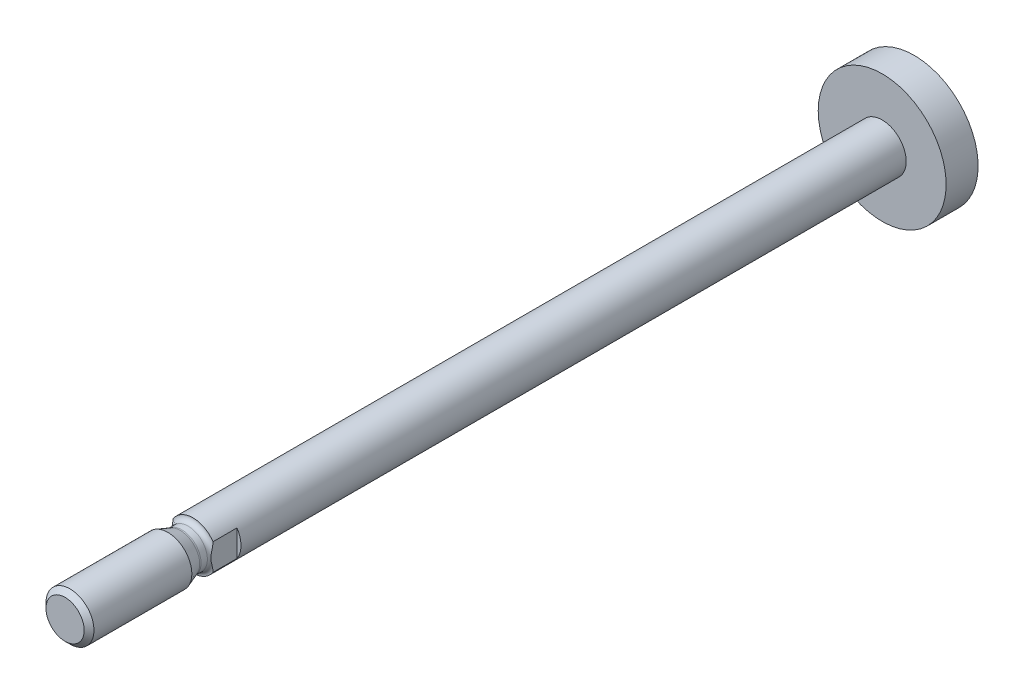
ISO-10303-21;
HEADER;
FILE_DESCRIPTION(('STEP AP214'),'2;1');
FILE_NAME('part.step','',(''),(''),'','','');
FILE_SCHEMA(('AUTOMOTIVE_DESIGN { 1 0 10303 214 1 1 1 1 }'));
ENDSEC;
DATA;
#1=APPLICATION_CONTEXT('core data for automotive mechanical design processes');
#2=APPLICATION_PROTOCOL_DEFINITION('international standard','automotive_design',2000,#1);
#3=PRODUCT_CONTEXT('',#1,'mechanical');
#4=PRODUCT('Part','Part','',(#3));
#5=PRODUCT_RELATED_PRODUCT_CATEGORY('part','',(#4));
#6=PRODUCT_DEFINITION_FORMATION('','',#4);
#7=PRODUCT_DEFINITION_CONTEXT('part definition',#1,'design');
#8=PRODUCT_DEFINITION('design','',#6,#7);
#9=PRODUCT_DEFINITION_SHAPE('','',#8);
#10=(LENGTH_UNIT() NAMED_UNIT(*) SI_UNIT(.MILLI.,.METRE.));
#11=(NAMED_UNIT(*) PLANE_ANGLE_UNIT() SI_UNIT($,.RADIAN.));
#12=(NAMED_UNIT(*) SI_UNIT($,.STERADIAN.) SOLID_ANGLE_UNIT());
#13=UNCERTAINTY_MEASURE_WITH_UNIT(LENGTH_MEASURE(1.E-05),#10,'distance_accuracy_value','');
#14=(GEOMETRIC_REPRESENTATION_CONTEXT(3) GLOBAL_UNCERTAINTY_ASSIGNED_CONTEXT((#13)) GLOBAL_UNIT_ASSIGNED_CONTEXT((#10,
#11,#12)) REPRESENTATION_CONTEXT('',''));
#15=CARTESIAN_POINT('',(0.,0.,0.));
#16=DIRECTION('',(0.,0.,1.));
#17=DIRECTION('',(1.,0.,0.));
#18=AXIS2_PLACEMENT_3D('',#15,#16,#17);
#19=CARTESIAN_POINT('',(0.,0.,-85.2));
#20=DIRECTION('',(0.,0.,-1.));
#21=DIRECTION('',(-1.,0.,0.));
#22=AXIS2_PLACEMENT_3D('',#19,#20,#21);
#23=CYLINDRICAL_SURFACE('',#22,3.);
#24=CARTESIAN_POINT('',(0.,0.,-81.2));
#25=DIRECTION('',(0.,0.,-1.));
#26=DIRECTION('',(-1.,0.,0.));
#27=AXIS2_PLACEMENT_3D('',#24,#25,#26);
#28=CIRCLE('',#27,3.);
#29=CARTESIAN_POINT('',(-3.,0.,-81.2));
#30=VERTEX_POINT('',#29);
#31=EDGE_CURVE('E80',#30,#30,#28,.T.);
#32=ORIENTED_EDGE('',*,*,#31,.F.);
#33=EDGE_LOOP('',(#32));
#34=FACE_BOUND('',#33,.T.);
#35=DIRECTION('',(0.,0.,-1.));
#36=VECTOR('',#35,1.);
#37=CARTESIAN_POINT('',(-2.5,1.6583123951777,4.99999999999909));
#38=LINE('',#37,#36);
#39=CARTESIAN_POINT('',(-2.5,1.65831239517778,4.99999999999909));
#40=VERTEX_POINT('',#39);
#41=CARTESIAN_POINT('',(-2.5,1.6583123951777,2.));
#42=VERTEX_POINT('',#41);
#43=EDGE_CURVE('E69',#40,#42,#38,.T.);
#44=ORIENTED_EDGE('',*,*,#43,.F.);
#45=CARTESIAN_POINT('',(0.,0.,5.));
#46=DIRECTION('',(0.,0.,-1.));
#47=DIRECTION('',(-0.833333333333321,0.552770798392585,0.));
#48=AXIS2_PLACEMENT_3D('',#45,#46,#47);
#49=CIRCLE('',#48,3.);
#50=CARTESIAN_POINT('',(2.5,1.6583123951777,5.));
#51=VERTEX_POINT('',#50);
#52=EDGE_CURVE('E55',#40,#51,#49,.T.);
#53=ORIENTED_EDGE('',*,*,#52,.T.);
#54=DIRECTION('',(0.,0.,1.));
#55=VECTOR('',#54,1.);
#56=CARTESIAN_POINT('',(2.5,1.6583123951777,2.));
#57=LINE('',#56,#55);
#58=CARTESIAN_POINT('',(2.5,1.6583123951777,2.));
#59=VERTEX_POINT('',#58);
#60=EDGE_CURVE('E68',#59,#51,#57,.T.);
#61=ORIENTED_EDGE('',*,*,#60,.F.);
#62=CARTESIAN_POINT('',(0.,0.,2.));
#63=DIRECTION('',(0.,0.,1.));
#64=DIRECTION('',(0.833333333333333,-0.552770798392567,0.));
#65=AXIS2_PLACEMENT_3D('',#62,#63,#64);
#66=CIRCLE('',#65,3.);
#67=CARTESIAN_POINT('',(2.5,-1.6583123951777,2.));
#68=VERTEX_POINT('',#67);
#69=EDGE_CURVE('E90',#68,#59,#66,.T.);
#70=ORIENTED_EDGE('',*,*,#69,.F.);
#71=DIRECTION('',(0.,0.,-1.));
#72=VECTOR('',#71,1.);
#73=CARTESIAN_POINT('',(2.5,-1.6583123951777,4.99999999999909));
#74=LINE('',#73,#72);
#75=CARTESIAN_POINT('',(2.5,-1.65831239517778,4.99999999999909));
#76=VERTEX_POINT('',#75);
#77=EDGE_CURVE('E94',#76,#68,#74,.T.);
#78=ORIENTED_EDGE('',*,*,#77,.F.);
#79=CARTESIAN_POINT('',(0.,0.,5.));
#80=DIRECTION('',(0.,0.,-1.));
#81=DIRECTION('',(0.833333333333321,-0.552770798392585,0.));
#82=AXIS2_PLACEMENT_3D('',#79,#80,#81);
#83=CIRCLE('',#82,3.);
#84=CARTESIAN_POINT('',(-2.5,-1.6583123951777,5.));
#85=VERTEX_POINT('',#84);
#86=EDGE_CURVE('E99',#76,#85,#83,.T.);
#87=ORIENTED_EDGE('',*,*,#86,.T.);
#88=DIRECTION('',(0.,0.,1.));
#89=VECTOR('',#88,1.);
#90=CARTESIAN_POINT('',(-2.5,-1.6583123951777,2.));
#91=LINE('',#90,#89);
#92=CARTESIAN_POINT('',(-2.5,-1.6583123951777,2.));
#93=VERTEX_POINT('',#92);
#94=EDGE_CURVE('E77',#93,#85,#91,.T.);
#95=ORIENTED_EDGE('',*,*,#94,.F.);
#96=CARTESIAN_POINT('',(0.,0.,2.));
#97=DIRECTION('',(0.,0.,1.));
#98=DIRECTION('',(-0.833333333333333,0.552770798392567,0.));
#99=AXIS2_PLACEMENT_3D('',#96,#97,#98);
#100=CIRCLE('',#99,3.);
#101=EDGE_CURVE('E34',#42,#93,#100,.T.);
#102=ORIENTED_EDGE('',*,*,#101,.F.);
#103=EDGE_LOOP('',(#44,#53,#61,#70,#78,#87,#95,#102));
#104=FACE_BOUND('',#103,.T.);
#105=ADVANCED_FACE('F17',(#34,#104),#23,.T.);
#106=CARTESIAN_POINT('',(0.,3.,-81.2));
#107=DIRECTION('',(0.,0.,-1.));
#108=DIRECTION('',(-1.,0.,0.));
#109=AXIS2_PLACEMENT_3D('',#106,#107,#108);
#110=PLANE('',#109);
#111=CARTESIAN_POINT('',(0.,0.,-81.2));
#112=DIRECTION('',(0.,0.,-1.));
#113=DIRECTION('',(-1.,0.,0.));
#114=AXIS2_PLACEMENT_3D('',#111,#112,#113);
#115=CIRCLE('',#114,8.);
#116=CARTESIAN_POINT('',(-8.,0.,-81.2));
#117=VERTEX_POINT('',#116);
#118=EDGE_CURVE('E109',#117,#117,#115,.T.);
#119=ORIENTED_EDGE('',*,*,#118,.F.);
#120=EDGE_LOOP('',(#119));
#121=FACE_BOUND('',#120,.T.);
#122=ORIENTED_EDGE('',*,*,#31,.T.);
#123=EDGE_LOOP('',(#122));
#124=FACE_BOUND('',#123,.T.);
#125=ADVANCED_FACE('F119',(#121,#124),#110,.F.);
#126=CARTESIAN_POINT('',(-2.5,-5.,6.));
#127=DIRECTION('',(-1.,0.,0.));
#128=DIRECTION('',(0.,0.,1.));
#129=AXIS2_PLACEMENT_3D('',#126,#127,#128);
#130=PLANE('',#129);
#131=ORIENTED_EDGE('',*,*,#43,.T.);
#132=DIRECTION('',(0.,1.,0.));
#133=VECTOR('',#132,1.);
#134=CARTESIAN_POINT('',(-2.5,-1.6583123951777,2.));
#135=LINE('',#134,#133);
#136=EDGE_CURVE('E31',#93,#42,#135,.T.);
#137=ORIENTED_EDGE('',*,*,#136,.F.);
#138=ORIENTED_EDGE('',*,*,#94,.T.);
#139=CARTESIAN_POINT('',(-2.5,-1.65831829169541,5.00000000000885));
#140=CARTESIAN_POINT('',(-2.5,-1.63491532877898,4.99999992973286));
#141=CARTESIAN_POINT('',(-2.5,-1.61149482046343,5.00041875125078));
#142=CARTESIAN_POINT('',(-2.5,-1.45329985222676,5.00583269208804));
#143=CARTESIAN_POINT('',(-2.5,-1.32008048780736,5.02291400118435));
#144=CARTESIAN_POINT('',(-2.5,-1.05526955750932,5.07061231229032));
#145=CARTESIAN_POINT('',(-2.5,-0.924587612317244,5.10126759833291));
#146=CARTESIAN_POINT('',(-2.5,-0.663403044787274,5.16510709196525));
#147=CARTESIAN_POINT('',(-2.5,-0.532955207719693,5.19852985989759));
#148=CARTESIAN_POINT('',(-2.5,-0.3351050647231,5.2375995275498));
#149=CARTESIAN_POINT('',(-2.5,-0.269167347488754,5.24862076501824));
#150=CARTESIAN_POINT('',(-2.5,-0.135243346078244,5.26407313721784));
#151=CARTESIAN_POINT('',(-2.5,-0.0659370163481887,5.26833752096453));
#152=CARTESIAN_POINT('',(-2.5,0.105328995263471,5.26833752096453));
#153=CARTESIAN_POINT('',(-2.5,0.204452731333742,5.25835623262265));
#154=CARTESIAN_POINT('',(-2.5,0.406625741882635,5.22538789194667));
#155=CARTESIAN_POINT('',(-2.5,0.506215999796735,5.20297777521126));
#156=CARTESIAN_POINT('',(-2.5,0.779290928519066,5.1376308856199));
#157=CARTESIAN_POINT('',(-2.5,0.952215632476059,5.09230978675975));
#158=CARTESIAN_POINT('',(-2.5,1.30286487229559,5.02381276997557));
#159=CARTESIAN_POINT('',(-2.5,1.47927159521248,4.9999999503834));
#160=CARTESIAN_POINT('',(-2.5,1.65831293934871,5.00000000000008));
#161=B_SPLINE_CURVE_WITH_KNOTS('',3,(#139,#140,#141,#142,#143,#144,#145,#146,#147,#148,#149,
#150,#151,#152,#153,#154,#155,#156,#157,#158,#159,#160),.UNSPECIFIED.,.F.,.F.,(4,2,2,2,2,2,2,2,
2,2,4),(9.64041016296276,9.70681215541733,10.0900053470554,10.4731985386934,10.8564820300666,
11.0481237757532,11.2397655214398,11.5458975492694,11.852029577099,12.3859060442365,
12.919782511374),.UNSPECIFIED.);
#162=EDGE_CURVE('E60',#85,#40,#161,.T.);
#163=ORIENTED_EDGE('',*,*,#162,.T.);
#164=EDGE_LOOP('',(#131,#137,#138,#163));
#165=FACE_BOUND('',#164,.T.);
#166=ADVANCED_FACE('F75',(#165),#130,.T.);
#167=CARTESIAN_POINT('',(0.,0.,5.6000000000001));
#168=DIRECTION('',(0.,0.,-1.));
#169=DIRECTION('',(-1.,0.,0.));
#170=AXIS2_PLACEMENT_3D('',#167,#168,#169);
#171=TOROIDAL_SURFACE('',#170,3.0000000000001,0.600000000000099);
#172=ORIENTED_EDGE('',*,*,#52,.F.);
#173=ORIENTED_EDGE('',*,*,#162,.F.);
#174=ORIENTED_EDGE('',*,*,#86,.F.);
#175=CARTESIAN_POINT('',(2.5,1.65831829169541,5.00000000000885));
#176=CARTESIAN_POINT('',(2.5,1.63491532877898,4.99999992973286));
#177=CARTESIAN_POINT('',(2.5,1.61149482046343,5.00041875125078));
#178=CARTESIAN_POINT('',(2.5,1.45329985222676,5.00583269208804));
#179=CARTESIAN_POINT('',(2.5,1.32008048780736,5.02291400118435));
#180=CARTESIAN_POINT('',(2.5,1.05526955750931,5.07061231229032));
#181=CARTESIAN_POINT('',(2.5,0.924587612317241,5.10126759833291));
#182=CARTESIAN_POINT('',(2.5,0.663403044787271,5.16510709196525));
#183=CARTESIAN_POINT('',(2.5,0.532955207719693,5.19852985989759));
#184=CARTESIAN_POINT('',(2.5,0.335105064723101,5.2375995275498));
#185=CARTESIAN_POINT('',(2.5,0.269167347488754,5.24862076501824));
#186=CARTESIAN_POINT('',(2.5,0.135243346078244,5.26407313721784));
#187=CARTESIAN_POINT('',(2.5,0.065937016348187,5.26833752096453));
#188=CARTESIAN_POINT('',(2.5,-0.105328995263471,5.26833752096453));
#189=CARTESIAN_POINT('',(2.5,-0.204452731333741,5.25835623262266));
#190=CARTESIAN_POINT('',(2.5,-0.406625741882635,5.22538789194667));
#191=CARTESIAN_POINT('',(2.5,-0.506215999796737,5.20297777521126));
#192=CARTESIAN_POINT('',(2.5,-0.779290928519067,5.1376308856199));
#193=CARTESIAN_POINT('',(2.5,-0.95221563247606,5.09230978675975));
#194=CARTESIAN_POINT('',(2.5,-1.30286487229559,5.02381276997557));
#195=CARTESIAN_POINT('',(2.5,-1.47927159521248,4.9999999503834));
#196=CARTESIAN_POINT('',(2.5,-1.65831293934871,5.00000000000008));
#197=B_SPLINE_CURVE_WITH_KNOTS('',3,(#175,#176,#177,#178,#179,#180,#181,#182,#183,#184,#185,
#186,#187,#188,#189,#190,#191,#192,#193,#194,#195,#196),.UNSPECIFIED.,.F.,.F.,(4,2,2,2,2,2,2,2,
2,2,4),(9.64041016296277,9.70681215541734,10.0900053470554,10.4731985386934,10.8564820300666,
11.0481237757532,11.2397655214398,11.5458975492694,11.852029577099,12.3859060442365,
12.9197825113741),.UNSPECIFIED.);
#198=EDGE_CURVE('E63',#51,#76,#197,.T.);
#199=ORIENTED_EDGE('',*,*,#198,.F.);
#200=EDGE_LOOP('',(#172,#173,#174,#199));
#201=FACE_BOUND('',#200,.T.);
#202=CARTESIAN_POINT('',(0.,0.,5.6));
#203=DIRECTION('',(0.,0.,-1.));
#204=DIRECTION('',(-1.,0.,0.));
#205=AXIS2_PLACEMENT_3D('',#202,#203,#204);
#206=CIRCLE('',#205,2.4);
#207=CARTESIAN_POINT('',(-2.4,0.,5.6));
#208=VERTEX_POINT('',#207);
#209=EDGE_CURVE('E155',#208,#208,#206,.T.);
#210=ORIENTED_EDGE('',*,*,#209,.T.);
#211=EDGE_LOOP('',(#210));
#212=FACE_BOUND('',#211,.T.);
#213=ADVANCED_FACE('F57',(#201,#212),#171,.F.);
#214=CARTESIAN_POINT('',(2.5,5.,6.));
#215=DIRECTION('',(1.,0.,0.));
#216=DIRECTION('',(0.,0.,-1.));
#217=AXIS2_PLACEMENT_3D('',#214,#215,#216);
#218=PLANE('',#217);
#219=ORIENTED_EDGE('',*,*,#77,.T.);
#220=DIRECTION('',(0.,-1.,0.));
#221=VECTOR('',#220,1.);
#222=CARTESIAN_POINT('',(2.5,1.6583123951777,2.));
#223=LINE('',#222,#221);
#224=EDGE_CURVE('E163',#59,#68,#223,.T.);
#225=ORIENTED_EDGE('',*,*,#224,.F.);
#226=ORIENTED_EDGE('',*,*,#60,.T.);
#227=ORIENTED_EDGE('',*,*,#198,.T.);
#228=EDGE_LOOP('',(#219,#225,#226,#227));
#229=FACE_BOUND('',#228,.T.);
#230=ADVANCED_FACE('F175',(#229),#218,.T.);
#231=CARTESIAN_POINT('',(0.,0.,2.));
#232=DIRECTION('',(0.,0.,1.));
#233=DIRECTION('',(1.,0.,0.));
#234=AXIS2_PLACEMENT_3D('',#231,#232,#233);
#235=PLANE('',#234);
#236=ORIENTED_EDGE('',*,*,#69,.T.);
#237=ORIENTED_EDGE('',*,*,#224,.T.);
#238=EDGE_LOOP('',(#236,#237));
#239=FACE_BOUND('',#238,.T.);
#240=ADVANCED_FACE('F184',(#239),#235,.T.);
#241=ORIENTED_EDGE('',*,*,#101,.T.);
#242=ORIENTED_EDGE('',*,*,#136,.T.);
#243=EDGE_LOOP('',(#241,#242));
#244=FACE_BOUND('',#243,.T.);
#245=ADVANCED_FACE('F187',(#244),#235,.T.);
#246=CARTESIAN_POINT('',(0.,0.,-85.2));
#247=DIRECTION('',(0.,0.,-1.));
#248=DIRECTION('',(-1.,0.,0.));
#249=AXIS2_PLACEMENT_3D('',#246,#247,#248);
#250=CYLINDRICAL_SURFACE('',#249,8.);
#251=CARTESIAN_POINT('',(0.,0.,-85.2));
#252=DIRECTION('',(0.,0.,-1.));
#253=DIRECTION('',(-1.,0.,0.));
#254=AXIS2_PLACEMENT_3D('',#251,#252,#253);
#255=CIRCLE('',#254,8.);
#256=CARTESIAN_POINT('',(-8.,0.,-85.2));
#257=VERTEX_POINT('',#256);
#258=EDGE_CURVE('E165',#257,#257,#255,.T.);
#259=ORIENTED_EDGE('',*,*,#258,.F.);
#260=EDGE_LOOP('',(#259));
#261=FACE_BOUND('',#260,.T.);
#262=ORIENTED_EDGE('',*,*,#118,.T.);
#263=EDGE_LOOP('',(#262));
#264=FACE_BOUND('',#263,.T.);
#265=ADVANCED_FACE('F117',(#261,#264),#250,.T.);
#266=CARTESIAN_POINT('',(0.,0.,4.));
#267=DIRECTION('',(0.,0.,-1.));
#268=DIRECTION('',(-1.,0.,0.));
#269=AXIS2_PLACEMENT_3D('',#266,#267,#268);
#270=CYLINDRICAL_SURFACE('',#269,2.4);
#271=ORIENTED_EDGE('',*,*,#209,.F.);
#272=EDGE_LOOP('',(#271));
#273=FACE_BOUND('',#272,.T.);
#274=CARTESIAN_POINT('',(0.,0.,6.3942038115749));
#275=DIRECTION('',(0.,0.,-1.));
#276=DIRECTION('',(-1.,0.,0.));
#277=AXIS2_PLACEMENT_3D('',#274,#275,#276);
#278=CIRCLE('',#277,2.4);
#279=CARTESIAN_POINT('',(-2.4,0.,6.3942038115749));
#280=VERTEX_POINT('',#279);
#281=EDGE_CURVE('E229',#280,#280,#278,.T.);
#282=ORIENTED_EDGE('',*,*,#281,.T.);
#283=EDGE_LOOP('',(#282));
#284=FACE_BOUND('',#283,.T.);
#285=ADVANCED_FACE('F191',(#273,#284),#270,.T.);
#286=CARTESIAN_POINT('',(0.,8.,-85.2));
#287=DIRECTION('',(0.,0.,1.));
#288=DIRECTION('',(1.,0.,0.));
#289=AXIS2_PLACEMENT_3D('',#286,#287,#288);
#290=PLANE('',#289);
#291=ORIENTED_EDGE('',*,*,#258,.T.);
#292=EDGE_LOOP('',(#291));
#293=FACE_BOUND('',#292,.T.);
#294=ADVANCED_FACE('F195',(#293),#290,.F.);
#295=CARTESIAN_POINT('',(0.,0.,6.39420381157483));
#296=DIRECTION('',(0.,0.,-1.));
#297=DIRECTION('',(-1.,0.,0.));
#298=AXIS2_PLACEMENT_3D('',#295,#296,#297);
#299=TOROIDAL_SURFACE('',#298,2.99999999999971,0.599999999999703);
#300=ORIENTED_EDGE('',*,*,#281,.F.);
#301=EDGE_LOOP('',(#300));
#302=FACE_BOUND('',#301,.T.);
#303=CARTESIAN_POINT('',(0.,0.,6.5994158975703));
#304=DIRECTION('',(0.,0.,-1.));
#305=DIRECTION('',(-1.,0.,0.));
#306=AXIS2_PLACEMENT_3D('',#303,#304,#305);
#307=CIRCLE('',#306,2.4361844275285);
#308=CARTESIAN_POINT('',(-2.4361844275285,0.,6.5994158975703));
#309=VERTEX_POINT('',#308);
#310=EDGE_CURVE('E225',#309,#309,#307,.T.);
#311=ORIENTED_EDGE('',*,*,#310,.T.);
#312=EDGE_LOOP('',(#311));
#313=FACE_BOUND('',#312,.T.);
#314=ADVANCED_FACE('F199',(#302,#313),#299,.F.);
#315=CARTESIAN_POINT('',(0.,0.,8.1484864516728));
#316=DIRECTION('',(0.,0.,1.));
#317=DIRECTION('',(1.,0.,0.));
#318=AXIS2_PLACEMENT_3D('',#315,#316,#317);
#319=CONICAL_SURFACE('',#318,3.,0.349065850398829);
#320=ORIENTED_EDGE('',*,*,#310,.F.);
#321=EDGE_LOOP('',(#320));
#322=FACE_BOUND('',#321,.T.);
#323=CARTESIAN_POINT('',(0.,0.,8.1484864516728));
#324=DIRECTION('',(0.,0.,-1.));
#325=DIRECTION('',(-1.,0.,0.));
#326=AXIS2_PLACEMENT_3D('',#323,#324,#325);
#327=CIRCLE('',#326,3.);
#328=CARTESIAN_POINT('',(-3.,0.,8.1484864516728));
#329=VERTEX_POINT('',#328);
#330=EDGE_CURVE('E223',#329,#329,#327,.T.);
#331=ORIENTED_EDGE('',*,*,#330,.T.);
#332=EDGE_LOOP('',(#331));
#333=FACE_BOUND('',#332,.T.);
#334=ADVANCED_FACE('F203',(#322,#333),#319,.T.);
#335=CARTESIAN_POINT('',(0.,0.,4.));
#336=DIRECTION('',(0.,0.,-1.));
#337=DIRECTION('',(-1.,0.,0.));
#338=AXIS2_PLACEMENT_3D('',#335,#336,#337);
#339=CYLINDRICAL_SURFACE('',#338,3.);
#340=ORIENTED_EDGE('',*,*,#330,.F.);
#341=EDGE_LOOP('',(#340));
#342=FACE_BOUND('',#341,.T.);
#343=CARTESIAN_POINT('',(0.,0.,20.3865));
#344=DIRECTION('',(0.,0.,-1.));
#345=DIRECTION('',(-1.,0.,0.));
#346=AXIS2_PLACEMENT_3D('',#343,#344,#345);
#347=CIRCLE('',#346,3.);
#348=CARTESIAN_POINT('',(-3.,0.,20.3865));
#349=VERTEX_POINT('',#348);
#350=EDGE_CURVE('E25',#349,#349,#347,.T.);
#351=ORIENTED_EDGE('',*,*,#350,.T.);
#352=EDGE_LOOP('',(#351));
#353=FACE_BOUND('',#352,.T.);
#354=ADVANCED_FACE('F207',(#342,#353),#339,.T.);
#355=CARTESIAN_POINT('',(0.,0.,21.));
#356=DIRECTION('',(0.,0.,-1.));
#357=DIRECTION('',(-1.,0.,0.));
#358=AXIS2_PLACEMENT_3D('',#355,#356,#357);
#359=CONICAL_SURFACE('',#358,2.3865,0.785398163397449);
#360=ORIENTED_EDGE('',*,*,#350,.F.);
#361=EDGE_LOOP('',(#360));
#362=FACE_BOUND('',#361,.T.);
#363=CARTESIAN_POINT('',(0.,0.,21.));
#364=DIRECTION('',(0.,0.,-1.));
#365=DIRECTION('',(-1.,0.,0.));
#366=AXIS2_PLACEMENT_3D('',#363,#364,#365);
#367=CIRCLE('',#366,2.3865);
#368=CARTESIAN_POINT('',(-2.3865,0.,21.));
#369=VERTEX_POINT('',#368);
#370=EDGE_CURVE('E11',#369,#369,#367,.T.);
#371=ORIENTED_EDGE('',*,*,#370,.T.);
#372=EDGE_LOOP('',(#371));
#373=FACE_BOUND('',#372,.T.);
#374=ADVANCED_FACE('F210',(#362,#373),#359,.T.);
#375=CARTESIAN_POINT('',(0.,0.,21.));
#376=DIRECTION('',(0.,0.,-1.));
#377=DIRECTION('',(-1.,0.,0.));
#378=AXIS2_PLACEMENT_3D('',#375,#376,#377);
#379=PLANE('',#378);
#380=ORIENTED_EDGE('',*,*,#370,.F.);
#381=EDGE_LOOP('',(#380));
#382=FACE_BOUND('',#381,.T.);
#383=ADVANCED_FACE('F19',(#382),#379,.F.);
#384=CLOSED_SHELL('',(#105,#125,#166,#213,#230,#240,#245,#265,#285,#294,#314,#334,#354,#374,#383));
#385=MANIFOLD_SOLID_BREP('B1',#384);
#386=ADVANCED_BREP_SHAPE_REPRESENTATION('',(#18,#385),#14);
#387=SHAPE_DEFINITION_REPRESENTATION(#9,#386);
ENDSEC;
END-ISO-10303-21;
